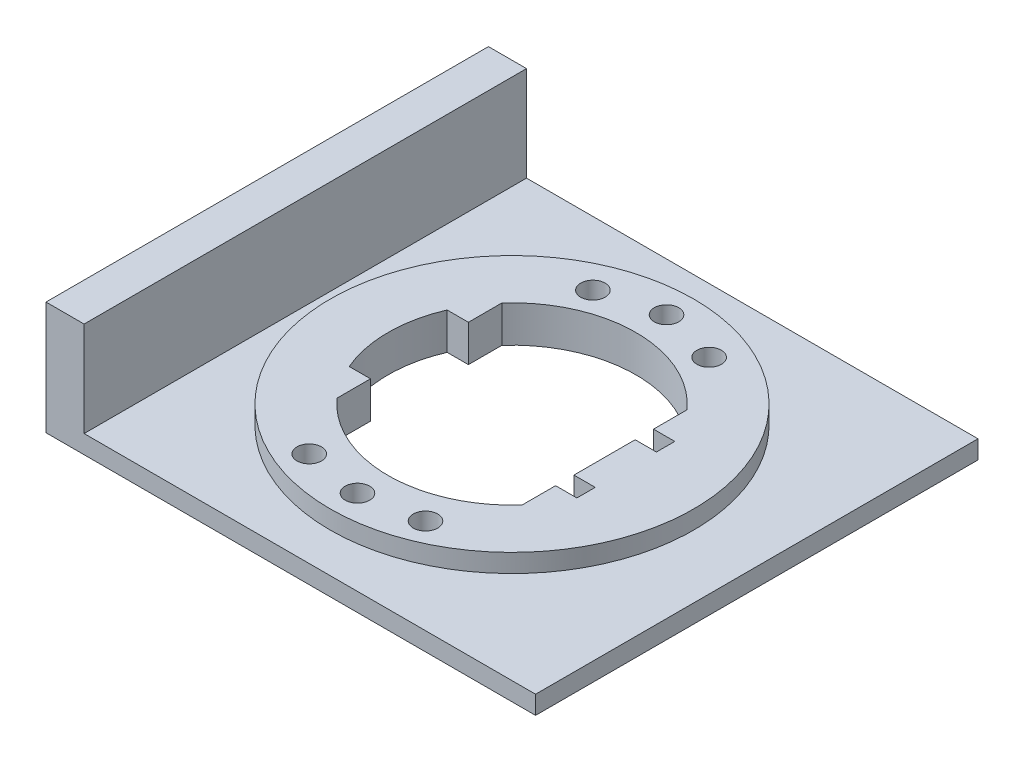
ISO-10303-21;
HEADER;
FILE_DESCRIPTION(('STEP AP214'),'2;1');
FILE_NAME('part.step','',(''),(''),'','','');
FILE_SCHEMA(('AUTOMOTIVE_DESIGN { 1 0 10303 214 1 1 1 1 }'));
ENDSEC;
DATA;
#1=APPLICATION_CONTEXT('core data for automotive mechanical design processes');
#2=APPLICATION_PROTOCOL_DEFINITION('international standard','automotive_design',2000,#1);
#3=PRODUCT_CONTEXT('',#1,'mechanical');
#4=PRODUCT('Part','Part','',(#3));
#5=PRODUCT_RELATED_PRODUCT_CATEGORY('part','',(#4));
#6=PRODUCT_DEFINITION_FORMATION('','',#4);
#7=PRODUCT_DEFINITION_CONTEXT('part definition',#1,'design');
#8=PRODUCT_DEFINITION('design','',#6,#7);
#9=PRODUCT_DEFINITION_SHAPE('','',#8);
#10=(LENGTH_UNIT() NAMED_UNIT(*) SI_UNIT(.MILLI.,.METRE.));
#11=(NAMED_UNIT(*) PLANE_ANGLE_UNIT() SI_UNIT($,.RADIAN.));
#12=(NAMED_UNIT(*) SI_UNIT($,.STERADIAN.) SOLID_ANGLE_UNIT());
#13=UNCERTAINTY_MEASURE_WITH_UNIT(LENGTH_MEASURE(1.E-05),#10,'distance_accuracy_value','');
#14=(GEOMETRIC_REPRESENTATION_CONTEXT(3) GLOBAL_UNCERTAINTY_ASSIGNED_CONTEXT((#13)) GLOBAL_UNIT_ASSIGNED_CONTEXT((#10,
#11,#12)) REPRESENTATION_CONTEXT('',''));
#15=CARTESIAN_POINT('',(0.,0.,0.));
#16=DIRECTION('',(0.,0.,1.));
#17=DIRECTION('',(1.,0.,0.));
#18=AXIS2_PLACEMENT_3D('',#15,#16,#17);
#19=CARTESIAN_POINT('',(-38.4533424136748,3.,-1.51012870901468));
#20=DIRECTION('',(0.,1.,0.));
#21=DIRECTION('',(0.,0.,1.));
#22=AXIS2_PLACEMENT_3D('',#19,#20,#21);
#23=PLANE('',#22);
#24=CARTESIAN_POINT('',(1.54665758632518,3.,-37.6601287090147));
#25=DIRECTION('',(0.,1.,0.));
#26=DIRECTION('',(0.,0.,1.));
#27=AXIS2_PLACEMENT_3D('',#24,#25,#26);
#28=CIRCLE('',#27,29.705);
#29=CARTESIAN_POINT('',(1.54665758632518,3.,-7.95512870901468));
#30=VERTEX_POINT('',#29);
#31=EDGE_CURVE('E371',#30,#30,#28,.T.);
#32=ORIENTED_EDGE('',*,*,#31,.F.);
#33=EDGE_LOOP('',(#32));
#34=FACE_BOUND('',#33,.T.);
#35=DIRECTION('',(-1.,0.,0.));
#36=VECTOR('',#35,1.);
#37=CARTESIAN_POINT('',(-38.4533424136748,3.,-73.8101287090147));
#38=LINE('',#37,#36);
#39=CARTESIAN_POINT('',(41.5466575863252,3.,-73.8101287090147));
#40=VERTEX_POINT('',#39);
#41=CARTESIAN_POINT('',(-32.2275933760281,3.,-73.8101287090147));
#42=VERTEX_POINT('',#41);
#43=EDGE_CURVE('E50',#40,#42,#38,.T.);
#44=ORIENTED_EDGE('',*,*,#43,.T.);
#45=DIRECTION('',(0.,0.,-1.));
#46=VECTOR('',#45,1.);
#47=CARTESIAN_POINT('',(-32.2275933760281,3.,-73.8101287090147));
#48=LINE('',#47,#46);
#49=CARTESIAN_POINT('',(-32.2275933760281,3.,-1.51012870901468));
#50=VERTEX_POINT('',#49);
#51=EDGE_CURVE('E54',#50,#42,#48,.T.);
#52=ORIENTED_EDGE('',*,*,#51,.F.);
#53=DIRECTION('',(1.,0.,0.));
#54=VECTOR('',#53,1.);
#55=CARTESIAN_POINT('',(-38.4533424136748,3.,-1.51012870901468));
#56=LINE('',#55,#54);
#57=CARTESIAN_POINT('',(41.5466575863252,3.,-1.51012870901468));
#58=VERTEX_POINT('',#57);
#59=EDGE_CURVE('E374',#50,#58,#56,.T.);
#60=ORIENTED_EDGE('',*,*,#59,.T.);
#61=DIRECTION('',(0.,0.,-1.));
#62=VECTOR('',#61,1.);
#63=CARTESIAN_POINT('',(41.5466575863252,3.,-73.8101287090147));
#64=LINE('',#63,#62);
#65=EDGE_CURVE('E378',#58,#40,#64,.T.);
#66=ORIENTED_EDGE('',*,*,#65,.T.);
#67=EDGE_LOOP('',(#44,#52,#60,#66));
#68=FACE_BOUND('',#67,.T.);
#69=ADVANCED_FACE('F35',(#34,#68),#23,.T.);
#70=CARTESIAN_POINT('',(-38.4533424136748,0.,-73.8101287090147));
#71=DIRECTION('',(0.,-1.,0.));
#72=DIRECTION('',(0.,0.,-1.));
#73=AXIS2_PLACEMENT_3D('',#70,#71,#72);
#74=PLANE('',#73);
#75=CARTESIAN_POINT('',(-7.95334241367481,0.,-14.0265658129032));
#76=DIRECTION('',(0.,1.,0.));
#77=DIRECTION('',(0.,0.,1.));
#78=AXIS2_PLACEMENT_3D('',#75,#76,#77);
#79=CIRCLE('',#78,2.00000000000001);
#80=CARTESIAN_POINT('',(-7.95334241367481,0.,-12.0265658129032));
#81=VERTEX_POINT('',#80);
#82=EDGE_CURVE('E212',#81,#81,#79,.T.);
#83=ORIENTED_EDGE('',*,*,#82,.T.);
#84=EDGE_LOOP('',(#83));
#85=FACE_BOUND('',#84,.T.);
#86=CARTESIAN_POINT('',(11.0466575863252,0.,-14.0265658129032));
#87=DIRECTION('',(0.,1.,0.));
#88=DIRECTION('',(0.,0.,1.));
#89=AXIS2_PLACEMENT_3D('',#86,#87,#88);
#90=CIRCLE('',#89,2.);
#91=CARTESIAN_POINT('',(11.0466575863252,0.,-12.0265658129032));
#92=VERTEX_POINT('',#91);
#93=EDGE_CURVE('E218',#92,#92,#90,.T.);
#94=ORIENTED_EDGE('',*,*,#93,.T.);
#95=EDGE_LOOP('',(#94));
#96=FACE_BOUND('',#95,.T.);
#97=CARTESIAN_POINT('',(11.0466575863252,0.,-60.3765658129032));
#98=DIRECTION('',(0.,1.,0.));
#99=DIRECTION('',(0.,0.,1.));
#100=AXIS2_PLACEMENT_3D('',#97,#98,#99);
#101=CIRCLE('',#100,2.);
#102=CARTESIAN_POINT('',(11.0466575863252,0.,-58.3765658129032));
#103=VERTEX_POINT('',#102);
#104=EDGE_CURVE('E224',#103,#103,#101,.T.);
#105=ORIENTED_EDGE('',*,*,#104,.T.);
#106=EDGE_LOOP('',(#105));
#107=FACE_BOUND('',#106,.T.);
#108=CARTESIAN_POINT('',(-7.95334241367482,0.,-60.3765658129032));
#109=DIRECTION('',(0.,1.,0.));
#110=DIRECTION('',(0.,0.,1.));
#111=AXIS2_PLACEMENT_3D('',#108,#109,#110);
#112=CIRCLE('',#111,2.00000000000001);
#113=CARTESIAN_POINT('',(-7.95334241367482,0.,-58.3765658129032));
#114=VERTEX_POINT('',#113);
#115=EDGE_CURVE('E230',#114,#114,#112,.T.);
#116=ORIENTED_EDGE('',*,*,#115,.T.);
#117=EDGE_LOOP('',(#116));
#118=FACE_BOUND('',#117,.T.);
#119=CARTESIAN_POINT('',(1.54665758632519,0.,-62.9101287090147));
#120=DIRECTION('',(0.,1.,0.));
#121=DIRECTION('',(0.,0.,1.));
#122=AXIS2_PLACEMENT_3D('',#119,#120,#121);
#123=CIRCLE('',#122,2.);
#124=CARTESIAN_POINT('',(1.54665758632519,0.,-60.9101287090147));
#125=VERTEX_POINT('',#124);
#126=EDGE_CURVE('E236',#125,#125,#123,.T.);
#127=ORIENTED_EDGE('',*,*,#126,.T.);
#128=EDGE_LOOP('',(#127));
#129=FACE_BOUND('',#128,.T.);
#130=CARTESIAN_POINT('',(1.54665758632519,0.,-12.4101287090147));
#131=DIRECTION('',(0.,1.,0.));
#132=DIRECTION('',(0.,0.,1.));
#133=AXIS2_PLACEMENT_3D('',#130,#131,#132);
#134=CIRCLE('',#133,2.);
#135=CARTESIAN_POINT('',(1.54665758632519,0.,-10.4101287090147));
#136=VERTEX_POINT('',#135);
#137=EDGE_CURVE('E242',#136,#136,#134,.T.);
#138=ORIENTED_EDGE('',*,*,#137,.T.);
#139=EDGE_LOOP('',(#138));
#140=FACE_BOUND('',#139,.T.);
#141=DIRECTION('',(0.,0.,1.));
#142=VECTOR('',#141,1.);
#143=CARTESIAN_POINT('',(-38.4533424136748,0.,-1.51012870901468));
#144=LINE('',#143,#142);
#145=CARTESIAN_POINT('',(-38.4533424136748,0.,-73.8101287090147));
#146=VERTEX_POINT('',#145);
#147=CARTESIAN_POINT('',(-38.4533424136748,0.,-1.51012870901468));
#148=VERTEX_POINT('',#147);
#149=EDGE_CURVE('E185',#146,#148,#144,.T.);
#150=ORIENTED_EDGE('',*,*,#149,.F.);
#151=DIRECTION('',(-1.,0.,0.));
#152=VECTOR('',#151,1.);
#153=CARTESIAN_POINT('',(-38.4533424136748,0.,-73.8101287090147));
#154=LINE('',#153,#152);
#155=CARTESIAN_POINT('',(41.5466575863252,0.,-73.8101287090147));
#156=VERTEX_POINT('',#155);
#157=EDGE_CURVE('E387',#156,#146,#154,.T.);
#158=ORIENTED_EDGE('',*,*,#157,.F.);
#159=DIRECTION('',(0.,0.,-1.));
#160=VECTOR('',#159,1.);
#161=CARTESIAN_POINT('',(41.5466575863252,0.,-1.51012870901468));
#162=LINE('',#161,#160);
#163=CARTESIAN_POINT('',(41.5466575863252,0.,-1.51012870901468));
#164=VERTEX_POINT('',#163);
#165=EDGE_CURVE('E384',#164,#156,#162,.T.);
#166=ORIENTED_EDGE('',*,*,#165,.F.);
#167=DIRECTION('',(1.,0.,0.));
#168=VECTOR('',#167,1.);
#169=CARTESIAN_POINT('',(-38.4533424136748,0.,-1.51012870901468));
#170=LINE('',#169,#168);
#171=EDGE_CURVE('E382',#148,#164,#170,.T.);
#172=ORIENTED_EDGE('',*,*,#171,.F.);
#173=EDGE_LOOP('',(#150,#158,#166,#172));
#174=FACE_BOUND('',#173,.T.);
#175=DIRECTION('',(0.,0.,1.));
#176=VECTOR('',#175,1.);
#177=CARTESIAN_POINT('',(-13.5780333196074,0.,-37.6601287090147));
#178=LINE('',#177,#176);
#179=CARTESIAN_POINT('',(-13.5780333196074,0.,-51.1251287090147));
#180=VERTEX_POINT('',#179);
#181=CARTESIAN_POINT('',(-13.5780333196074,0.,-45.6601287090147));
#182=VERTEX_POINT('',#181);
#183=EDGE_CURVE('E288',#180,#182,#178,.T.);
#184=ORIENTED_EDGE('',*,*,#183,.T.);
#185=DIRECTION('',(1.,0.,0.));
#186=VECTOR('',#185,1.);
#187=CARTESIAN_POINT('',(-63.9457637699121,0.,-45.6601287090147));
#188=LINE('',#187,#186);
#189=CARTESIAN_POINT('',(-17.0560975859605,0.,-45.6601287090147));
#190=VERTEX_POINT('',#189);
#191=EDGE_CURVE('E248',#190,#182,#188,.T.);
#192=ORIENTED_EDGE('',*,*,#191,.F.);
#193=CARTESIAN_POINT('',(1.54665758632518,0.,-37.6601287090147));
#194=DIRECTION('',(0.,1.,0.));
#195=DIRECTION('',(0.,0.,1.));
#196=AXIS2_PLACEMENT_3D('',#193,#194,#195);
#197=CIRCLE('',#196,20.25);
#198=CARTESIAN_POINT('',(-17.0560975859605,0.,-29.6601287090147));
#199=VERTEX_POINT('',#198);
#200=EDGE_CURVE('E250',#190,#199,#197,.T.);
#201=ORIENTED_EDGE('',*,*,#200,.T.);
#202=DIRECTION('',(1.,0.,0.));
#203=VECTOR('',#202,1.);
#204=CARTESIAN_POINT('',(-63.9457637699121,0.,-29.6601287090147));
#205=LINE('',#204,#203);
#206=CARTESIAN_POINT('',(-13.5780333196074,0.,-29.6601287090147));
#207=VERTEX_POINT('',#206);
#208=EDGE_CURVE('E254',#199,#207,#205,.T.);
#209=ORIENTED_EDGE('',*,*,#208,.T.);
#210=DIRECTION('',(0.,0.,1.));
#211=VECTOR('',#210,1.);
#212=CARTESIAN_POINT('',(-13.5780333196074,0.,-37.6601287090147));
#213=LINE('',#212,#211);
#214=CARTESIAN_POINT('',(-13.5780333196074,0.,-24.1951287090147));
#215=VERTEX_POINT('',#214);
#216=EDGE_CURVE('E257',#207,#215,#213,.T.);
#217=ORIENTED_EDGE('',*,*,#216,.T.);
#218=CARTESIAN_POINT('',(1.54665758632518,0.,-37.6601287090147));
#219=DIRECTION('',(0.,1.,0.));
#220=DIRECTION('',(0.,0.,1.));
#221=AXIS2_PLACEMENT_3D('',#218,#219,#220);
#222=CIRCLE('',#221,20.25);
#223=CARTESIAN_POINT('',(16.6713484922578,0.,-24.1951287090147));
#224=VERTEX_POINT('',#223);
#225=EDGE_CURVE('E260',#215,#224,#222,.T.);
#226=ORIENTED_EDGE('',*,*,#225,.T.);
#227=DIRECTION('',(0.,0.,1.));
#228=VECTOR('',#227,1.);
#229=CARTESIAN_POINT('',(16.6713484922578,0.,-37.6601287090147));
#230=LINE('',#229,#228);
#231=CARTESIAN_POINT('',(16.6713484922578,0.,-29.6601287090147));
#232=VERTEX_POINT('',#231);
#233=EDGE_CURVE('E263',#232,#224,#230,.T.);
#234=ORIENTED_EDGE('',*,*,#233,.F.);
#235=DIRECTION('',(1.,0.,0.));
#236=VECTOR('',#235,1.);
#237=CARTESIAN_POINT('',(-63.9457637699121,0.,-29.6601287090147));
#238=LINE('',#237,#236);
#239=CARTESIAN_POINT('',(20.1494127586108,0.,-29.6601287090147));
#240=VERTEX_POINT('',#239);
#241=EDGE_CURVE('E265',#232,#240,#238,.T.);
#242=ORIENTED_EDGE('',*,*,#241,.T.);
#243=DIRECTION('',(0.,0.,-1.));
#244=VECTOR('',#243,1.);
#245=CARTESIAN_POINT('',(20.1494127586108,0.,-37.6601287090147));
#246=LINE('',#245,#244);
#247=CARTESIAN_POINT('',(20.1494127586108,0.,-32.6601287090147));
#248=VERTEX_POINT('',#247);
#249=EDGE_CURVE('E268',#240,#248,#246,.T.);
#250=ORIENTED_EDGE('',*,*,#249,.T.);
#251=DIRECTION('',(-1.,0.,0.));
#252=VECTOR('',#251,1.);
#253=CARTESIAN_POINT('',(-63.9457637699121,0.,-32.6601287090148));
#254=LINE('',#253,#252);
#255=CARTESIAN_POINT('',(16.6713484922578,0.,-32.6601287090147));
#256=VERTEX_POINT('',#255);
#257=EDGE_CURVE('E271',#248,#256,#254,.T.);
#258=ORIENTED_EDGE('',*,*,#257,.T.);
#259=DIRECTION('',(0.,0.,1.));
#260=VECTOR('',#259,1.);
#261=CARTESIAN_POINT('',(16.6713484922578,0.,-37.6601287090147));
#262=LINE('',#261,#260);
#263=CARTESIAN_POINT('',(16.6713484922578,0.,-42.6601287090147));
#264=VERTEX_POINT('',#263);
#265=EDGE_CURVE('E274',#264,#256,#262,.T.);
#266=ORIENTED_EDGE('',*,*,#265,.F.);
#267=DIRECTION('',(-1.,0.,0.));
#268=VECTOR('',#267,1.);
#269=CARTESIAN_POINT('',(-63.9457637699121,0.,-42.6601287090147));
#270=LINE('',#269,#268);
#271=CARTESIAN_POINT('',(20.1494127586108,0.,-42.6601287090147));
#272=VERTEX_POINT('',#271);
#273=EDGE_CURVE('E276',#272,#264,#270,.T.);
#274=ORIENTED_EDGE('',*,*,#273,.F.);
#275=DIRECTION('',(0.,0.,-1.));
#276=VECTOR('',#275,1.);
#277=CARTESIAN_POINT('',(20.1494127586108,0.,-37.6601287090147));
#278=LINE('',#277,#276);
#279=CARTESIAN_POINT('',(20.1494127586108,0.,-45.6601287090147));
#280=VERTEX_POINT('',#279);
#281=EDGE_CURVE('E278',#272,#280,#278,.T.);
#282=ORIENTED_EDGE('',*,*,#281,.T.);
#283=DIRECTION('',(1.,0.,0.));
#284=VECTOR('',#283,1.);
#285=CARTESIAN_POINT('',(-63.9457637699121,0.,-45.6601287090147));
#286=LINE('',#285,#284);
#287=CARTESIAN_POINT('',(16.6713484922578,0.,-45.6601287090147));
#288=VERTEX_POINT('',#287);
#289=EDGE_CURVE('E281',#288,#280,#286,.T.);
#290=ORIENTED_EDGE('',*,*,#289,.F.);
#291=DIRECTION('',(0.,0.,1.));
#292=VECTOR('',#291,1.);
#293=CARTESIAN_POINT('',(16.6713484922578,0.,-37.6601287090147));
#294=LINE('',#293,#292);
#295=CARTESIAN_POINT('',(16.6713484922578,0.,-51.1251287090147));
#296=VERTEX_POINT('',#295);
#297=EDGE_CURVE('E283',#296,#288,#294,.T.);
#298=ORIENTED_EDGE('',*,*,#297,.F.);
#299=CARTESIAN_POINT('',(1.54665758632518,0.,-37.6601287090147));
#300=DIRECTION('',(0.,1.,0.));
#301=DIRECTION('',(0.,0.,1.));
#302=AXIS2_PLACEMENT_3D('',#299,#300,#301);
#303=CIRCLE('',#302,20.25);
#304=EDGE_CURVE('E285',#296,#180,#303,.T.);
#305=ORIENTED_EDGE('',*,*,#304,.T.);
#306=EDGE_LOOP('',(#184,#192,#201,#209,#217,#226,#234,#242,#250,#258,#266,#274,#282,#290,#298,#305));
#307=FACE_BOUND('',#306,.T.);
#308=ADVANCED_FACE('F401',(#85,#96,#107,#118,#129,#140,#174,#307),#74,.T.);
#309=CARTESIAN_POINT('',(-38.4533424136748,6.,-73.8101287090147));
#310=DIRECTION('',(0.,-1.,0.));
#311=DIRECTION('',(0.,0.,-1.));
#312=AXIS2_PLACEMENT_3D('',#309,#310,#311);
#313=PLANE('',#312);
#314=CARTESIAN_POINT('',(-7.95334241367481,6.,-14.0265658129032));
#315=DIRECTION('',(0.,1.,0.));
#316=DIRECTION('',(0.,0.,1.));
#317=AXIS2_PLACEMENT_3D('',#314,#315,#316);
#318=CIRCLE('',#317,2.00000000000001);
#319=CARTESIAN_POINT('',(-7.95334241367481,6.,-12.0265658129032));
#320=VERTEX_POINT('',#319);
#321=EDGE_CURVE('E211',#320,#320,#318,.T.);
#322=ORIENTED_EDGE('',*,*,#321,.F.);
#323=EDGE_LOOP('',(#322));
#324=FACE_BOUND('',#323,.T.);
#325=CARTESIAN_POINT('',(11.0466575863252,6.,-14.0265658129032));
#326=DIRECTION('',(0.,1.,0.));
#327=DIRECTION('',(0.,0.,1.));
#328=AXIS2_PLACEMENT_3D('',#325,#326,#327);
#329=CIRCLE('',#328,2.);
#330=CARTESIAN_POINT('',(11.0466575863252,6.,-12.0265658129032));
#331=VERTEX_POINT('',#330);
#332=EDGE_CURVE('E215',#331,#331,#329,.T.);
#333=ORIENTED_EDGE('',*,*,#332,.F.);
#334=EDGE_LOOP('',(#333));
#335=FACE_BOUND('',#334,.T.);
#336=CARTESIAN_POINT('',(11.0466575863252,6.,-60.3765658129032));
#337=DIRECTION('',(0.,1.,0.));
#338=DIRECTION('',(0.,0.,1.));
#339=AXIS2_PLACEMENT_3D('',#336,#337,#338);
#340=CIRCLE('',#339,2.);
#341=CARTESIAN_POINT('',(11.0466575863252,6.,-58.3765658129032));
#342=VERTEX_POINT('',#341);
#343=EDGE_CURVE('E221',#342,#342,#340,.T.);
#344=ORIENTED_EDGE('',*,*,#343,.F.);
#345=EDGE_LOOP('',(#344));
#346=FACE_BOUND('',#345,.T.);
#347=CARTESIAN_POINT('',(-7.95334241367482,6.,-60.3765658129032));
#348=DIRECTION('',(0.,1.,0.));
#349=DIRECTION('',(0.,0.,1.));
#350=AXIS2_PLACEMENT_3D('',#347,#348,#349);
#351=CIRCLE('',#350,2.00000000000001);
#352=CARTESIAN_POINT('',(-7.95334241367482,6.,-58.3765658129032));
#353=VERTEX_POINT('',#352);
#354=EDGE_CURVE('E227',#353,#353,#351,.T.);
#355=ORIENTED_EDGE('',*,*,#354,.F.);
#356=EDGE_LOOP('',(#355));
#357=FACE_BOUND('',#356,.T.);
#358=CARTESIAN_POINT('',(1.54665758632519,6.,-62.9101287090147));
#359=DIRECTION('',(0.,1.,0.));
#360=DIRECTION('',(0.,0.,1.));
#361=AXIS2_PLACEMENT_3D('',#358,#359,#360);
#362=CIRCLE('',#361,2.);
#363=CARTESIAN_POINT('',(1.54665758632519,6.,-60.9101287090147));
#364=VERTEX_POINT('',#363);
#365=EDGE_CURVE('E233',#364,#364,#362,.T.);
#366=ORIENTED_EDGE('',*,*,#365,.F.);
#367=EDGE_LOOP('',(#366));
#368=FACE_BOUND('',#367,.T.);
#369=CARTESIAN_POINT('',(1.54665758632519,6.,-12.4101287090147));
#370=DIRECTION('',(0.,1.,0.));
#371=DIRECTION('',(0.,0.,1.));
#372=AXIS2_PLACEMENT_3D('',#369,#370,#371);
#373=CIRCLE('',#372,2.);
#374=CARTESIAN_POINT('',(1.54665758632519,6.,-10.4101287090147));
#375=VERTEX_POINT('',#374);
#376=EDGE_CURVE('E239',#375,#375,#373,.T.);
#377=ORIENTED_EDGE('',*,*,#376,.F.);
#378=EDGE_LOOP('',(#377));
#379=FACE_BOUND('',#378,.T.);
#380=CARTESIAN_POINT('',(1.54665758632518,6.,-37.6601287090147));
#381=DIRECTION('',(0.,1.,0.));
#382=DIRECTION('',(0.,0.,1.));
#383=AXIS2_PLACEMENT_3D('',#380,#381,#382);
#384=CIRCLE('',#383,29.705);
#385=CARTESIAN_POINT('',(1.54665758632518,6.,-7.95512870901468));
#386=VERTEX_POINT('',#385);
#387=EDGE_CURVE('E340',#386,#386,#384,.T.);
#388=ORIENTED_EDGE('',*,*,#387,.T.);
#389=EDGE_LOOP('',(#388));
#390=FACE_BOUND('',#389,.T.);
#391=DIRECTION('',(1.,0.,0.));
#392=VECTOR('',#391,1.);
#393=CARTESIAN_POINT('',(-63.9457637699121,6.,-45.6601287090147));
#394=LINE('',#393,#392);
#395=CARTESIAN_POINT('',(-17.0560975859605,6.,-45.6601287090147));
#396=VERTEX_POINT('',#395);
#397=CARTESIAN_POINT('',(-13.5780333196074,6.,-45.6601287090147));
#398=VERTEX_POINT('',#397);
#399=EDGE_CURVE('E245',#396,#398,#394,.T.);
#400=ORIENTED_EDGE('',*,*,#399,.T.);
#401=DIRECTION('',(0.,0.,1.));
#402=VECTOR('',#401,1.);
#403=CARTESIAN_POINT('',(-13.5780333196074,6.,-37.6601287090147));
#404=LINE('',#403,#402);
#405=CARTESIAN_POINT('',(-13.5780333196074,6.,-51.1251287090147));
#406=VERTEX_POINT('',#405);
#407=EDGE_CURVE('E251',#406,#398,#404,.T.);
#408=ORIENTED_EDGE('',*,*,#407,.F.);
#409=CARTESIAN_POINT('',(1.54665758632518,6.,-37.6601287090147));
#410=DIRECTION('',(0.,1.,0.));
#411=DIRECTION('',(0.,0.,1.));
#412=AXIS2_PLACEMENT_3D('',#409,#410,#411);
#413=CIRCLE('',#412,20.25);
#414=CARTESIAN_POINT('',(16.6713484922578,6.,-51.1251287090147));
#415=VERTEX_POINT('',#414);
#416=EDGE_CURVE('E333',#415,#406,#413,.T.);
#417=ORIENTED_EDGE('',*,*,#416,.F.);
#418=DIRECTION('',(0.,0.,1.));
#419=VECTOR('',#418,1.);
#420=CARTESIAN_POINT('',(16.6713484922578,6.,-37.6601287090147));
#421=LINE('',#420,#419);
#422=CARTESIAN_POINT('',(16.6713484922578,6.,-45.6601287090147));
#423=VERTEX_POINT('',#422);
#424=EDGE_CURVE('E330',#415,#423,#421,.T.);
#425=ORIENTED_EDGE('',*,*,#424,.T.);
#426=DIRECTION('',(1.,0.,0.));
#427=VECTOR('',#426,1.);
#428=CARTESIAN_POINT('',(-63.9457637699121,6.,-45.6601287090147));
#429=LINE('',#428,#427);
#430=CARTESIAN_POINT('',(20.1494127586108,6.,-45.6601287090147));
#431=VERTEX_POINT('',#430);
#432=EDGE_CURVE('E327',#423,#431,#429,.T.);
#433=ORIENTED_EDGE('',*,*,#432,.T.);
#434=DIRECTION('',(0.,0.,-1.));
#435=VECTOR('',#434,1.);
#436=CARTESIAN_POINT('',(20.1494127586108,6.,-37.6601287090147));
#437=LINE('',#436,#435);
#438=CARTESIAN_POINT('',(20.1494127586108,6.,-42.6601287090147));
#439=VERTEX_POINT('',#438);
#440=EDGE_CURVE('E324',#439,#431,#437,.T.);
#441=ORIENTED_EDGE('',*,*,#440,.F.);
#442=DIRECTION('',(-1.,0.,0.));
#443=VECTOR('',#442,1.);
#444=CARTESIAN_POINT('',(-63.9457637699121,6.,-42.6601287090147));
#445=LINE('',#444,#443);
#446=CARTESIAN_POINT('',(16.6713484922578,6.,-42.6601287090147));
#447=VERTEX_POINT('',#446);
#448=EDGE_CURVE('E321',#439,#447,#445,.T.);
#449=ORIENTED_EDGE('',*,*,#448,.T.);
#450=DIRECTION('',(0.,0.,1.));
#451=VECTOR('',#450,1.);
#452=CARTESIAN_POINT('',(16.6713484922578,6.,-37.6601287090147));
#453=LINE('',#452,#451);
#454=CARTESIAN_POINT('',(16.6713484922578,6.,-32.6601287090147));
#455=VERTEX_POINT('',#454);
#456=EDGE_CURVE('E318',#447,#455,#453,.T.);
#457=ORIENTED_EDGE('',*,*,#456,.T.);
#458=DIRECTION('',(-1.,0.,0.));
#459=VECTOR('',#458,1.);
#460=CARTESIAN_POINT('',(-63.9457637699121,6.,-32.6601287090148));
#461=LINE('',#460,#459);
#462=CARTESIAN_POINT('',(20.1494127586108,6.,-32.6601287090147));
#463=VERTEX_POINT('',#462);
#464=EDGE_CURVE('E315',#463,#455,#461,.T.);
#465=ORIENTED_EDGE('',*,*,#464,.F.);
#466=DIRECTION('',(0.,0.,-1.));
#467=VECTOR('',#466,1.);
#468=CARTESIAN_POINT('',(20.1494127586108,6.,-37.6601287090147));
#469=LINE('',#468,#467);
#470=CARTESIAN_POINT('',(20.1494127586108,6.,-29.6601287090147));
#471=VERTEX_POINT('',#470);
#472=EDGE_CURVE('E312',#471,#463,#469,.T.);
#473=ORIENTED_EDGE('',*,*,#472,.F.);
#474=DIRECTION('',(1.,0.,0.));
#475=VECTOR('',#474,1.);
#476=CARTESIAN_POINT('',(-63.9457637699121,6.,-29.6601287090147));
#477=LINE('',#476,#475);
#478=CARTESIAN_POINT('',(16.6713484922578,6.,-29.6601287090147));
#479=VERTEX_POINT('',#478);
#480=EDGE_CURVE('E309',#479,#471,#477,.T.);
#481=ORIENTED_EDGE('',*,*,#480,.F.);
#482=DIRECTION('',(0.,0.,1.));
#483=VECTOR('',#482,1.);
#484=CARTESIAN_POINT('',(16.6713484922578,6.,-37.6601287090147));
#485=LINE('',#484,#483);
#486=CARTESIAN_POINT('',(16.6713484922578,6.,-24.1951287090147));
#487=VERTEX_POINT('',#486);
#488=EDGE_CURVE('E306',#479,#487,#485,.T.);
#489=ORIENTED_EDGE('',*,*,#488,.T.);
#490=CARTESIAN_POINT('',(1.54665758632518,6.,-37.6601287090147));
#491=DIRECTION('',(0.,1.,0.));
#492=DIRECTION('',(0.,0.,1.));
#493=AXIS2_PLACEMENT_3D('',#490,#491,#492);
#494=CIRCLE('',#493,20.25);
#495=CARTESIAN_POINT('',(-13.5780333196074,6.,-24.1951287090147));
#496=VERTEX_POINT('',#495);
#497=EDGE_CURVE('E303',#496,#487,#494,.T.);
#498=ORIENTED_EDGE('',*,*,#497,.F.);
#499=DIRECTION('',(0.,0.,1.));
#500=VECTOR('',#499,1.);
#501=CARTESIAN_POINT('',(-13.5780333196074,6.,-37.6601287090147));
#502=LINE('',#501,#500);
#503=CARTESIAN_POINT('',(-13.5780333196074,6.,-29.6601287090147));
#504=VERTEX_POINT('',#503);
#505=EDGE_CURVE('E300',#504,#496,#502,.T.);
#506=ORIENTED_EDGE('',*,*,#505,.F.);
#507=DIRECTION('',(1.,0.,0.));
#508=VECTOR('',#507,1.);
#509=CARTESIAN_POINT('',(-63.9457637699121,6.,-29.6601287090147));
#510=LINE('',#509,#508);
#511=CARTESIAN_POINT('',(-17.0560975859605,6.,-29.6601287090147));
#512=VERTEX_POINT('',#511);
#513=EDGE_CURVE('E297',#512,#504,#510,.T.);
#514=ORIENTED_EDGE('',*,*,#513,.F.);
#515=CARTESIAN_POINT('',(1.54665758632518,6.,-37.6601287090147));
#516=DIRECTION('',(0.,1.,0.));
#517=DIRECTION('',(0.,0.,1.));
#518=AXIS2_PLACEMENT_3D('',#515,#516,#517);
#519=CIRCLE('',#518,20.25);
#520=EDGE_CURVE('E294',#396,#512,#519,.T.);
#521=ORIENTED_EDGE('',*,*,#520,.F.);
#522=EDGE_LOOP('',(#400,#408,#417,#425,#433,#441,#449,#457,#465,#473,#481,#489,#498,#506,#514,#521));
#523=FACE_BOUND('',#522,.T.);
#524=ADVANCED_FACE('F425',(#324,#335,#346,#357,#368,#379,#390,#523),#313,.F.);
#525=CARTESIAN_POINT('',(-38.4533424136748,6.,-1.51012870901468));
#526=DIRECTION('',(1.,0.,0.));
#527=DIRECTION('',(0.,0.,-1.));
#528=AXIS2_PLACEMENT_3D('',#525,#526,#527);
#529=PLANE('',#528);
#530=DIRECTION('',(0.,-1.,0.));
#531=VECTOR('',#530,1.);
#532=CARTESIAN_POINT('',(-38.4533424136748,6.,-1.51012870901468));
#533=LINE('',#532,#531);
#534=CARTESIAN_POINT('',(-38.4533424136748,18.5,-1.51012870901468));
#535=VERTEX_POINT('',#534);
#536=EDGE_CURVE('E11',#535,#148,#533,.T.);
#537=ORIENTED_EDGE('',*,*,#536,.F.);
#538=DIRECTION('',(0.,0.,1.));
#539=VECTOR('',#538,1.);
#540=CARTESIAN_POINT('',(-38.4533424136748,18.5,-73.8101287090147));
#541=LINE('',#540,#539);
#542=CARTESIAN_POINT('',(-38.4533424136748,18.5,-73.8101287090147));
#543=VERTEX_POINT('',#542);
#544=EDGE_CURVE('E183',#543,#535,#541,.T.);
#545=ORIENTED_EDGE('',*,*,#544,.F.);
#546=DIRECTION('',(0.,-1.,0.));
#547=VECTOR('',#546,1.);
#548=CARTESIAN_POINT('',(-38.4533424136748,6.,-73.8101287090147));
#549=LINE('',#548,#547);
#550=EDGE_CURVE('E390',#543,#146,#549,.T.);
#551=ORIENTED_EDGE('',*,*,#550,.T.);
#552=ORIENTED_EDGE('',*,*,#149,.T.);
#553=EDGE_LOOP('',(#537,#545,#551,#552));
#554=FACE_BOUND('',#553,.T.);
#555=ADVANCED_FACE('F37',(#554),#529,.F.);
#556=CARTESIAN_POINT('',(-38.4533424136748,6.,-1.51012870901468));
#557=DIRECTION('',(0.,0.,-1.));
#558=DIRECTION('',(-1.,0.,0.));
#559=AXIS2_PLACEMENT_3D('',#556,#557,#558);
#560=PLANE('',#559);
#561=ORIENTED_EDGE('',*,*,#59,.F.);
#562=DIRECTION('',(0.,-1.,0.));
#563=VECTOR('',#562,1.);
#564=CARTESIAN_POINT('',(-32.2275933760281,18.5,-1.51012870901468));
#565=LINE('',#564,#563);
#566=CARTESIAN_POINT('',(-32.2275933760281,18.5,-1.51012870901468));
#567=VERTEX_POINT('',#566);
#568=EDGE_CURVE('E193',#567,#50,#565,.T.);
#569=ORIENTED_EDGE('',*,*,#568,.F.);
#570=DIRECTION('',(1.,0.,0.));
#571=VECTOR('',#570,1.);
#572=CARTESIAN_POINT('',(-38.4533424136748,18.5,-1.51012870901468));
#573=LINE('',#572,#571);
#574=EDGE_CURVE('E190',#535,#567,#573,.T.);
#575=ORIENTED_EDGE('',*,*,#574,.F.);
#576=ORIENTED_EDGE('',*,*,#536,.T.);
#577=ORIENTED_EDGE('',*,*,#171,.T.);
#578=DIRECTION('',(0.,-1.,0.));
#579=VECTOR('',#578,1.);
#580=CARTESIAN_POINT('',(41.5466575863252,6.,-1.51012870901468));
#581=LINE('',#580,#579);
#582=EDGE_CURVE('E43',#58,#164,#581,.T.);
#583=ORIENTED_EDGE('',*,*,#582,.F.);
#584=EDGE_LOOP('',(#561,#569,#575,#576,#577,#583));
#585=FACE_BOUND('',#584,.T.);
#586=ADVANCED_FACE('F191',(#585),#560,.F.);
#587=CARTESIAN_POINT('',(41.5466575863252,6.,-1.51012870901468));
#588=DIRECTION('',(-1.,0.,0.));
#589=DIRECTION('',(0.,0.,1.));
#590=AXIS2_PLACEMENT_3D('',#587,#588,#589);
#591=PLANE('',#590);
#592=ORIENTED_EDGE('',*,*,#65,.F.);
#593=ORIENTED_EDGE('',*,*,#582,.T.);
#594=ORIENTED_EDGE('',*,*,#165,.T.);
#595=DIRECTION('',(0.,-1.,0.));
#596=VECTOR('',#595,1.);
#597=CARTESIAN_POINT('',(41.5466575863252,6.,-73.8101287090147));
#598=LINE('',#597,#596);
#599=EDGE_CURVE('E392',#40,#156,#598,.T.);
#600=ORIENTED_EDGE('',*,*,#599,.F.);
#601=EDGE_LOOP('',(#592,#593,#594,#600));
#602=FACE_BOUND('',#601,.T.);
#603=ADVANCED_FACE('F396',(#602),#591,.F.);
#604=CARTESIAN_POINT('',(-38.4533424136748,6.,-73.8101287090147));
#605=DIRECTION('',(0.,0.,1.));
#606=DIRECTION('',(1.,0.,0.));
#607=AXIS2_PLACEMENT_3D('',#604,#605,#606);
#608=PLANE('',#607);
#609=ORIENTED_EDGE('',*,*,#43,.F.);
#610=ORIENTED_EDGE('',*,*,#599,.T.);
#611=ORIENTED_EDGE('',*,*,#157,.T.);
#612=ORIENTED_EDGE('',*,*,#550,.F.);
#613=DIRECTION('',(-1.,0.,0.));
#614=VECTOR('',#613,1.);
#615=CARTESIAN_POINT('',(-38.4533424136748,18.5,-73.8101287090147));
#616=LINE('',#615,#614);
#617=CARTESIAN_POINT('',(-32.2275933760281,18.5,-73.8101287090147));
#618=VERTEX_POINT('',#617);
#619=EDGE_CURVE('E201',#618,#543,#616,.T.);
#620=ORIENTED_EDGE('',*,*,#619,.F.);
#621=DIRECTION('',(0.,-1.,0.));
#622=VECTOR('',#621,1.);
#623=CARTESIAN_POINT('',(-32.2275933760281,18.5,-73.8101287090147));
#624=LINE('',#623,#622);
#625=EDGE_CURVE('E206',#618,#42,#624,.T.);
#626=ORIENTED_EDGE('',*,*,#625,.T.);
#627=EDGE_LOOP('',(#609,#610,#611,#612,#620,#626));
#628=FACE_BOUND('',#627,.T.);
#629=ADVANCED_FACE('F404',(#628),#608,.F.);
#630=CARTESIAN_POINT('',(1.54665758632518,3.,-37.6601287090147));
#631=DIRECTION('',(0.,1.,0.));
#632=DIRECTION('',(0.,0.,1.));
#633=AXIS2_PLACEMENT_3D('',#630,#631,#632);
#634=CYLINDRICAL_SURFACE('',#633,29.705);
#635=ORIENTED_EDGE('',*,*,#31,.T.);
#636=EDGE_LOOP('',(#635));
#637=FACE_BOUND('',#636,.T.);
#638=ORIENTED_EDGE('',*,*,#387,.F.);
#639=EDGE_LOOP('',(#638));
#640=FACE_BOUND('',#639,.T.);
#641=ADVANCED_FACE('F431',(#637,#640),#634,.T.);
#642=CARTESIAN_POINT('',(-63.9457637699121,0.,-45.6601287090147));
#643=DIRECTION('',(0.,0.,1.));
#644=DIRECTION('',(1.,0.,0.));
#645=AXIS2_PLACEMENT_3D('',#642,#643,#644);
#646=PLANE('',#645);
#647=ORIENTED_EDGE('',*,*,#399,.F.);
#648=DIRECTION('',(0.,1.,0.));
#649=VECTOR('',#648,1.);
#650=CARTESIAN_POINT('',(-17.0560975859605,0.,-45.6601287090147));
#651=LINE('',#650,#649);
#652=EDGE_CURVE('E291',#190,#396,#651,.T.);
#653=ORIENTED_EDGE('',*,*,#652,.F.);
#654=ORIENTED_EDGE('',*,*,#191,.T.);
#655=DIRECTION('',(0.,1.,0.));
#656=VECTOR('',#655,1.);
#657=CARTESIAN_POINT('',(-13.5780333196074,0.,-45.6601287090147));
#658=LINE('',#657,#656);
#659=EDGE_CURVE('E338',#182,#398,#658,.T.);
#660=ORIENTED_EDGE('',*,*,#659,.T.);
#661=EDGE_LOOP('',(#647,#653,#654,#660));
#662=FACE_BOUND('',#661,.T.);
#663=ADVANCED_FACE('F634',(#662),#646,.T.);
#664=CARTESIAN_POINT('',(-13.5780333196074,0.,-37.6601287090147));
#665=DIRECTION('',(-1.,0.,0.));
#666=DIRECTION('',(0.,0.,1.));
#667=AXIS2_PLACEMENT_3D('',#664,#665,#666);
#668=PLANE('',#667);
#669=ORIENTED_EDGE('',*,*,#407,.T.);
#670=ORIENTED_EDGE('',*,*,#659,.F.);
#671=ORIENTED_EDGE('',*,*,#183,.F.);
#672=DIRECTION('',(0.,1.,0.));
#673=VECTOR('',#672,1.);
#674=CARTESIAN_POINT('',(-13.5780333196074,0.,-51.1251287090147));
#675=LINE('',#674,#673);
#676=EDGE_CURVE('E341',#180,#406,#675,.T.);
#677=ORIENTED_EDGE('',*,*,#676,.T.);
#678=EDGE_LOOP('',(#669,#670,#671,#677));
#679=FACE_BOUND('',#678,.T.);
#680=ADVANCED_FACE('F624',(#679),#668,.F.);
#681=CARTESIAN_POINT('',(1.54665758632518,0.,-37.6601287090147));
#682=DIRECTION('',(0.,1.,0.));
#683=DIRECTION('',(0.,0.,1.));
#684=AXIS2_PLACEMENT_3D('',#681,#682,#683);
#685=CYLINDRICAL_SURFACE('',#684,20.25);
#686=ORIENTED_EDGE('',*,*,#416,.T.);
#687=ORIENTED_EDGE('',*,*,#676,.F.);
#688=ORIENTED_EDGE('',*,*,#304,.F.);
#689=DIRECTION('',(0.,1.,0.));
#690=VECTOR('',#689,1.);
#691=CARTESIAN_POINT('',(16.6713484922578,0.,-51.1251287090147));
#692=LINE('',#691,#690);
#693=EDGE_CURVE('E343',#296,#415,#692,.T.);
#694=ORIENTED_EDGE('',*,*,#693,.T.);
#695=EDGE_LOOP('',(#686,#687,#688,#694));
#696=FACE_BOUND('',#695,.T.);
#697=ADVANCED_FACE('F614',(#696),#685,.F.);
#698=CARTESIAN_POINT('',(16.6713484922578,0.,-37.6601287090147));
#699=DIRECTION('',(-1.,0.,0.));
#700=DIRECTION('',(0.,0.,1.));
#701=AXIS2_PLACEMENT_3D('',#698,#699,#700);
#702=PLANE('',#701);
#703=ORIENTED_EDGE('',*,*,#424,.F.);
#704=ORIENTED_EDGE('',*,*,#693,.F.);
#705=ORIENTED_EDGE('',*,*,#297,.T.);
#706=DIRECTION('',(0.,1.,0.));
#707=VECTOR('',#706,1.);
#708=CARTESIAN_POINT('',(16.6713484922578,0.,-45.6601287090147));
#709=LINE('',#708,#707);
#710=EDGE_CURVE('E345',#288,#423,#709,.T.);
#711=ORIENTED_EDGE('',*,*,#710,.T.);
#712=EDGE_LOOP('',(#703,#704,#705,#711));
#713=FACE_BOUND('',#712,.T.);
#714=ADVANCED_FACE('F603',(#713),#702,.T.);
#715=CARTESIAN_POINT('',(-63.9457637699121,0.,-45.6601287090147));
#716=DIRECTION('',(0.,0.,1.));
#717=DIRECTION('',(1.,0.,0.));
#718=AXIS2_PLACEMENT_3D('',#715,#716,#717);
#719=PLANE('',#718);
#720=ORIENTED_EDGE('',*,*,#432,.F.);
#721=ORIENTED_EDGE('',*,*,#710,.F.);
#722=ORIENTED_EDGE('',*,*,#289,.T.);
#723=DIRECTION('',(0.,1.,0.));
#724=VECTOR('',#723,1.);
#725=CARTESIAN_POINT('',(20.1494127586108,0.,-45.6601287090147));
#726=LINE('',#725,#724);
#727=EDGE_CURVE('E347',#280,#431,#726,.T.);
#728=ORIENTED_EDGE('',*,*,#727,.T.);
#729=EDGE_LOOP('',(#720,#721,#722,#728));
#730=FACE_BOUND('',#729,.T.);
#731=ADVANCED_FACE('F592',(#730),#719,.T.);
#732=CARTESIAN_POINT('',(20.1494127586108,0.,-37.6601287090147));
#733=DIRECTION('',(1.,0.,0.));
#734=DIRECTION('',(0.,0.,-1.));
#735=AXIS2_PLACEMENT_3D('',#732,#733,#734);
#736=PLANE('',#735);
#737=ORIENTED_EDGE('',*,*,#440,.T.);
#738=ORIENTED_EDGE('',*,*,#727,.F.);
#739=ORIENTED_EDGE('',*,*,#281,.F.);
#740=DIRECTION('',(0.,1.,0.));
#741=VECTOR('',#740,1.);
#742=CARTESIAN_POINT('',(20.1494127586108,0.,-42.6601287090147));
#743=LINE('',#742,#741);
#744=EDGE_CURVE('E349',#272,#439,#743,.T.);
#745=ORIENTED_EDGE('',*,*,#744,.T.);
#746=EDGE_LOOP('',(#737,#738,#739,#745));
#747=FACE_BOUND('',#746,.T.);
#748=ADVANCED_FACE('F581',(#747),#736,.F.);
#749=CARTESIAN_POINT('',(-63.9457637699121,0.,-42.6601287090147));
#750=DIRECTION('',(0.,0.,-1.));
#751=DIRECTION('',(-1.,0.,0.));
#752=AXIS2_PLACEMENT_3D('',#749,#750,#751);
#753=PLANE('',#752);
#754=ORIENTED_EDGE('',*,*,#448,.F.);
#755=ORIENTED_EDGE('',*,*,#744,.F.);
#756=ORIENTED_EDGE('',*,*,#273,.T.);
#757=DIRECTION('',(0.,1.,0.));
#758=VECTOR('',#757,1.);
#759=CARTESIAN_POINT('',(16.6713484922578,0.,-42.6601287090147));
#760=LINE('',#759,#758);
#761=EDGE_CURVE('E351',#264,#447,#760,.T.);
#762=ORIENTED_EDGE('',*,*,#761,.T.);
#763=EDGE_LOOP('',(#754,#755,#756,#762));
#764=FACE_BOUND('',#763,.T.);
#765=ADVANCED_FACE('F570',(#764),#753,.T.);
#766=CARTESIAN_POINT('',(16.6713484922578,0.,-37.6601287090147));
#767=DIRECTION('',(-1.,0.,0.));
#768=DIRECTION('',(0.,0.,1.));
#769=AXIS2_PLACEMENT_3D('',#766,#767,#768);
#770=PLANE('',#769);
#771=ORIENTED_EDGE('',*,*,#456,.F.);
#772=ORIENTED_EDGE('',*,*,#761,.F.);
#773=ORIENTED_EDGE('',*,*,#265,.T.);
#774=DIRECTION('',(0.,1.,0.));
#775=VECTOR('',#774,1.);
#776=CARTESIAN_POINT('',(16.6713484922578,0.,-32.6601287090147));
#777=LINE('',#776,#775);
#778=EDGE_CURVE('E353',#256,#455,#777,.T.);
#779=ORIENTED_EDGE('',*,*,#778,.T.);
#780=EDGE_LOOP('',(#771,#772,#773,#779));
#781=FACE_BOUND('',#780,.T.);
#782=ADVANCED_FACE('F560',(#781),#770,.T.);
#783=CARTESIAN_POINT('',(-63.9457637699121,0.,-32.6601287090148));
#784=DIRECTION('',(0.,0.,-1.));
#785=DIRECTION('',(-1.,0.,0.));
#786=AXIS2_PLACEMENT_3D('',#783,#784,#785);
#787=PLANE('',#786);
#788=ORIENTED_EDGE('',*,*,#464,.T.);
#789=ORIENTED_EDGE('',*,*,#778,.F.);
#790=ORIENTED_EDGE('',*,*,#257,.F.);
#791=DIRECTION('',(0.,1.,0.));
#792=VECTOR('',#791,1.);
#793=CARTESIAN_POINT('',(20.1494127586108,0.,-32.6601287090147));
#794=LINE('',#793,#792);
#795=EDGE_CURVE('E355',#248,#463,#794,.T.);
#796=ORIENTED_EDGE('',*,*,#795,.T.);
#797=EDGE_LOOP('',(#788,#789,#790,#796));
#798=FACE_BOUND('',#797,.T.);
#799=ADVANCED_FACE('F549',(#798),#787,.F.);
#800=CARTESIAN_POINT('',(20.1494127586108,0.,-37.6601287090147));
#801=DIRECTION('',(1.,0.,0.));
#802=DIRECTION('',(0.,0.,-1.));
#803=AXIS2_PLACEMENT_3D('',#800,#801,#802);
#804=PLANE('',#803);
#805=ORIENTED_EDGE('',*,*,#472,.T.);
#806=ORIENTED_EDGE('',*,*,#795,.F.);
#807=ORIENTED_EDGE('',*,*,#249,.F.);
#808=DIRECTION('',(0.,1.,0.));
#809=VECTOR('',#808,1.);
#810=CARTESIAN_POINT('',(20.1494127586108,0.,-29.6601287090147));
#811=LINE('',#810,#809);
#812=EDGE_CURVE('E357',#240,#471,#811,.T.);
#813=ORIENTED_EDGE('',*,*,#812,.T.);
#814=EDGE_LOOP('',(#805,#806,#807,#813));
#815=FACE_BOUND('',#814,.T.);
#816=ADVANCED_FACE('F538',(#815),#804,.F.);
#817=CARTESIAN_POINT('',(-63.9457637699121,0.,-29.6601287090147));
#818=DIRECTION('',(0.,0.,1.));
#819=DIRECTION('',(1.,0.,0.));
#820=AXIS2_PLACEMENT_3D('',#817,#818,#819);
#821=PLANE('',#820);
#822=ORIENTED_EDGE('',*,*,#480,.T.);
#823=ORIENTED_EDGE('',*,*,#812,.F.);
#824=ORIENTED_EDGE('',*,*,#241,.F.);
#825=DIRECTION('',(0.,1.,0.));
#826=VECTOR('',#825,1.);
#827=CARTESIAN_POINT('',(16.6713484922578,0.,-29.6601287090147));
#828=LINE('',#827,#826);
#829=EDGE_CURVE('E359',#232,#479,#828,.T.);
#830=ORIENTED_EDGE('',*,*,#829,.T.);
#831=EDGE_LOOP('',(#822,#823,#824,#830));
#832=FACE_BOUND('',#831,.T.);
#833=ADVANCED_FACE('F528',(#832),#821,.F.);
#834=CARTESIAN_POINT('',(16.6713484922578,0.,-37.6601287090147));
#835=DIRECTION('',(-1.,0.,0.));
#836=DIRECTION('',(0.,0.,1.));
#837=AXIS2_PLACEMENT_3D('',#834,#835,#836);
#838=PLANE('',#837);
#839=ORIENTED_EDGE('',*,*,#488,.F.);
#840=ORIENTED_EDGE('',*,*,#829,.F.);
#841=ORIENTED_EDGE('',*,*,#233,.T.);
#842=DIRECTION('',(0.,1.,0.));
#843=VECTOR('',#842,1.);
#844=CARTESIAN_POINT('',(16.6713484922578,0.,-24.1951287090147));
#845=LINE('',#844,#843);
#846=EDGE_CURVE('E361',#224,#487,#845,.T.);
#847=ORIENTED_EDGE('',*,*,#846,.T.);
#848=EDGE_LOOP('',(#839,#840,#841,#847));
#849=FACE_BOUND('',#848,.T.);
#850=ADVANCED_FACE('F518',(#849),#838,.T.);
#851=CARTESIAN_POINT('',(1.54665758632518,0.,-37.6601287090147));
#852=DIRECTION('',(0.,1.,0.));
#853=DIRECTION('',(0.,0.,1.));
#854=AXIS2_PLACEMENT_3D('',#851,#852,#853);
#855=CYLINDRICAL_SURFACE('',#854,20.25);
#856=ORIENTED_EDGE('',*,*,#497,.T.);
#857=ORIENTED_EDGE('',*,*,#846,.F.);
#858=ORIENTED_EDGE('',*,*,#225,.F.);
#859=DIRECTION('',(0.,1.,0.));
#860=VECTOR('',#859,1.);
#861=CARTESIAN_POINT('',(-13.5780333196074,0.,-24.1951287090147));
#862=LINE('',#861,#860);
#863=EDGE_CURVE('E363',#215,#496,#862,.T.);
#864=ORIENTED_EDGE('',*,*,#863,.T.);
#865=EDGE_LOOP('',(#856,#857,#858,#864));
#866=FACE_BOUND('',#865,.T.);
#867=ADVANCED_FACE('F508',(#866),#855,.F.);
#868=CARTESIAN_POINT('',(-13.5780333196074,0.,-37.6601287090147));
#869=DIRECTION('',(-1.,0.,0.));
#870=DIRECTION('',(0.,0.,1.));
#871=AXIS2_PLACEMENT_3D('',#868,#869,#870);
#872=PLANE('',#871);
#873=ORIENTED_EDGE('',*,*,#505,.T.);
#874=ORIENTED_EDGE('',*,*,#863,.F.);
#875=ORIENTED_EDGE('',*,*,#216,.F.);
#876=DIRECTION('',(0.,1.,0.));
#877=VECTOR('',#876,1.);
#878=CARTESIAN_POINT('',(-13.5780333196074,0.,-29.6601287090147));
#879=LINE('',#878,#877);
#880=EDGE_CURVE('E365',#207,#504,#879,.T.);
#881=ORIENTED_EDGE('',*,*,#880,.T.);
#882=EDGE_LOOP('',(#873,#874,#875,#881));
#883=FACE_BOUND('',#882,.T.);
#884=ADVANCED_FACE('F498',(#883),#872,.F.);
#885=CARTESIAN_POINT('',(-63.9457637699121,0.,-29.6601287090147));
#886=DIRECTION('',(0.,0.,1.));
#887=DIRECTION('',(1.,0.,0.));
#888=AXIS2_PLACEMENT_3D('',#885,#886,#887);
#889=PLANE('',#888);
#890=ORIENTED_EDGE('',*,*,#513,.T.);
#891=ORIENTED_EDGE('',*,*,#880,.F.);
#892=ORIENTED_EDGE('',*,*,#208,.F.);
#893=DIRECTION('',(0.,1.,0.));
#894=VECTOR('',#893,1.);
#895=CARTESIAN_POINT('',(-17.0560975859605,0.,-29.6601287090147));
#896=LINE('',#895,#894);
#897=EDGE_CURVE('E367',#199,#512,#896,.T.);
#898=ORIENTED_EDGE('',*,*,#897,.T.);
#899=EDGE_LOOP('',(#890,#891,#892,#898));
#900=FACE_BOUND('',#899,.T.);
#901=ADVANCED_FACE('F488',(#900),#889,.F.);
#902=CARTESIAN_POINT('',(1.54665758632518,0.,-37.6601287090147));
#903=DIRECTION('',(0.,1.,0.));
#904=DIRECTION('',(0.,0.,1.));
#905=AXIS2_PLACEMENT_3D('',#902,#903,#904);
#906=CYLINDRICAL_SURFACE('',#905,20.25);
#907=ORIENTED_EDGE('',*,*,#520,.T.);
#908=ORIENTED_EDGE('',*,*,#897,.F.);
#909=ORIENTED_EDGE('',*,*,#200,.F.);
#910=ORIENTED_EDGE('',*,*,#652,.T.);
#911=EDGE_LOOP('',(#907,#908,#909,#910));
#912=FACE_BOUND('',#911,.T.);
#913=ADVANCED_FACE('F478',(#912),#906,.F.);
#914=CARTESIAN_POINT('',(1.54665758632519,0.,-12.4101287090147));
#915=DIRECTION('',(0.,1.,0.));
#916=DIRECTION('',(0.,0.,1.));
#917=AXIS2_PLACEMENT_3D('',#914,#915,#916);
#918=CYLINDRICAL_SURFACE('',#917,2.);
#919=ORIENTED_EDGE('',*,*,#137,.F.);
#920=EDGE_LOOP('',(#919));
#921=FACE_BOUND('',#920,.T.);
#922=ORIENTED_EDGE('',*,*,#376,.T.);
#923=EDGE_LOOP('',(#922));
#924=FACE_BOUND('',#923,.T.);
#925=ADVANCED_FACE('F466',(#921,#924),#918,.F.);
#926=CARTESIAN_POINT('',(1.54665758632519,0.,-62.9101287090147));
#927=DIRECTION('',(0.,1.,0.));
#928=DIRECTION('',(0.,0.,1.));
#929=AXIS2_PLACEMENT_3D('',#926,#927,#928);
#930=CYLINDRICAL_SURFACE('',#929,2.);
#931=ORIENTED_EDGE('',*,*,#126,.F.);
#932=EDGE_LOOP('',(#931));
#933=FACE_BOUND('',#932,.T.);
#934=ORIENTED_EDGE('',*,*,#365,.T.);
#935=EDGE_LOOP('',(#934));
#936=FACE_BOUND('',#935,.T.);
#937=ADVANCED_FACE('F460',(#933,#936),#930,.F.);
#938=CARTESIAN_POINT('',(-7.95334241367482,0.,-60.3765658129032));
#939=DIRECTION('',(0.,1.,0.));
#940=DIRECTION('',(0.,0.,1.));
#941=AXIS2_PLACEMENT_3D('',#938,#939,#940);
#942=CYLINDRICAL_SURFACE('',#941,2.00000000000001);
#943=ORIENTED_EDGE('',*,*,#115,.F.);
#944=EDGE_LOOP('',(#943));
#945=FACE_BOUND('',#944,.T.);
#946=ORIENTED_EDGE('',*,*,#354,.T.);
#947=EDGE_LOOP('',(#946));
#948=FACE_BOUND('',#947,.T.);
#949=ADVANCED_FACE('F465',(#945,#948),#942,.F.);
#950=CARTESIAN_POINT('',(11.0466575863252,0.,-60.3765658129032));
#951=DIRECTION('',(0.,1.,0.));
#952=DIRECTION('',(0.,0.,1.));
#953=AXIS2_PLACEMENT_3D('',#950,#951,#952);
#954=CYLINDRICAL_SURFACE('',#953,2.);
#955=ORIENTED_EDGE('',*,*,#104,.F.);
#956=EDGE_LOOP('',(#955));
#957=FACE_BOUND('',#956,.T.);
#958=ORIENTED_EDGE('',*,*,#343,.T.);
#959=EDGE_LOOP('',(#958));
#960=FACE_BOUND('',#959,.T.);
#961=ADVANCED_FACE('F704',(#957,#960),#954,.F.);
#962=CARTESIAN_POINT('',(11.0466575863252,0.,-14.0265658129032));
#963=DIRECTION('',(0.,1.,0.));
#964=DIRECTION('',(0.,0.,1.));
#965=AXIS2_PLACEMENT_3D('',#962,#963,#964);
#966=CYLINDRICAL_SURFACE('',#965,2.);
#967=ORIENTED_EDGE('',*,*,#93,.F.);
#968=EDGE_LOOP('',(#967));
#969=FACE_BOUND('',#968,.T.);
#970=ORIENTED_EDGE('',*,*,#332,.T.);
#971=EDGE_LOOP('',(#970));
#972=FACE_BOUND('',#971,.T.);
#973=ADVANCED_FACE('F416',(#969,#972),#966,.F.);
#974=CARTESIAN_POINT('',(-7.95334241367481,0.,-14.0265658129032));
#975=DIRECTION('',(0.,1.,0.));
#976=DIRECTION('',(0.,0.,1.));
#977=AXIS2_PLACEMENT_3D('',#974,#975,#976);
#978=CYLINDRICAL_SURFACE('',#977,2.00000000000001);
#979=ORIENTED_EDGE('',*,*,#82,.F.);
#980=EDGE_LOOP('',(#979));
#981=FACE_BOUND('',#980,.T.);
#982=ORIENTED_EDGE('',*,*,#321,.T.);
#983=EDGE_LOOP('',(#982));
#984=FACE_BOUND('',#983,.T.);
#985=ADVANCED_FACE('F409',(#981,#984),#978,.F.);
#986=CARTESIAN_POINT('',(-32.2275933760281,18.5,-73.8101287090147));
#987=DIRECTION('',(-1.,0.,0.));
#988=DIRECTION('',(0.,0.,1.));
#989=AXIS2_PLACEMENT_3D('',#986,#987,#988);
#990=PLANE('',#989);
#991=ORIENTED_EDGE('',*,*,#51,.T.);
#992=ORIENTED_EDGE('',*,*,#625,.F.);
#993=DIRECTION('',(0.,0.,-1.));
#994=VECTOR('',#993,1.);
#995=CARTESIAN_POINT('',(-32.2275933760281,18.5,-73.8101287090147));
#996=LINE('',#995,#994);
#997=EDGE_CURVE('E196',#567,#618,#996,.T.);
#998=ORIENTED_EDGE('',*,*,#997,.F.);
#999=ORIENTED_EDGE('',*,*,#568,.T.);
#1000=EDGE_LOOP('',(#991,#992,#998,#999));
#1001=FACE_BOUND('',#1000,.T.);
#1002=ADVANCED_FACE('F407',(#1001),#990,.F.);
#1003=CARTESIAN_POINT('',(-38.4533424136748,18.5,-1.51012870901468));
#1004=DIRECTION('',(0.,1.,0.));
#1005=DIRECTION('',(0.,0.,1.));
#1006=AXIS2_PLACEMENT_3D('',#1003,#1004,#1005);
#1007=PLANE('',#1006);
#1008=ORIENTED_EDGE('',*,*,#544,.T.);
#1009=ORIENTED_EDGE('',*,*,#574,.T.);
#1010=ORIENTED_EDGE('',*,*,#997,.T.);
#1011=ORIENTED_EDGE('',*,*,#619,.T.);
#1012=EDGE_LOOP('',(#1008,#1009,#1010,#1011));
#1013=FACE_BOUND('',#1012,.T.);
#1014=ADVANCED_FACE('F199',(#1013),#1007,.T.);
#1015=CLOSED_SHELL('',(#69,#308,#524,#555,#586,#603,#629,#641,#663,#680,#697,#714,#731,#748,
#765,#782,#799,#816,#833,#850,#867,#884,#901,#913,#925,#937,#949,#961,#973,#985,#1002,#1014));
#1016=MANIFOLD_SOLID_BREP('B2',#1015);
#1017=ADVANCED_BREP_SHAPE_REPRESENTATION('',(#18,#1016),#14);
#1018=SHAPE_DEFINITION_REPRESENTATION(#9,#1017);
ENDSEC;
END-ISO-10303-21;
